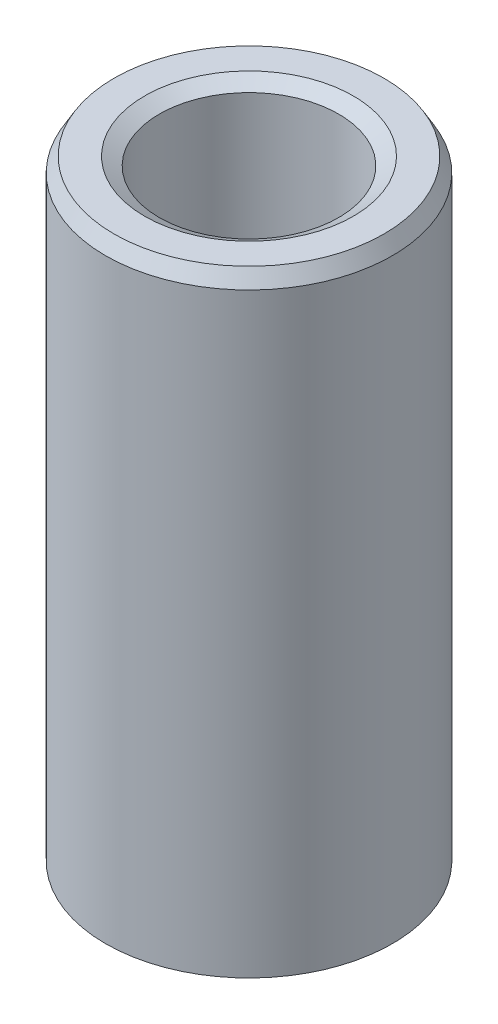
ISO-10303-21;
HEADER;
FILE_DESCRIPTION(('STEP AP214'),'2;1');
FILE_NAME('part.step','',(''),(''),'','','');
FILE_SCHEMA(('AUTOMOTIVE_DESIGN { 1 0 10303 214 1 1 1 1 }'));
ENDSEC;
DATA;
#1=APPLICATION_CONTEXT('core data for automotive mechanical design processes');
#2=APPLICATION_PROTOCOL_DEFINITION('international standard','automotive_design',2000,#1);
#3=PRODUCT_CONTEXT('',#1,'mechanical');
#4=PRODUCT('Part','Part','',(#3));
#5=PRODUCT_RELATED_PRODUCT_CATEGORY('part','',(#4));
#6=PRODUCT_DEFINITION_FORMATION('','',#4);
#7=PRODUCT_DEFINITION_CONTEXT('part definition',#1,'design');
#8=PRODUCT_DEFINITION('design','',#6,#7);
#9=PRODUCT_DEFINITION_SHAPE('','',#8);
#10=(LENGTH_UNIT() NAMED_UNIT(*) SI_UNIT(.MILLI.,.METRE.));
#11=(NAMED_UNIT(*) PLANE_ANGLE_UNIT() SI_UNIT($,.RADIAN.));
#12=(NAMED_UNIT(*) SI_UNIT($,.STERADIAN.) SOLID_ANGLE_UNIT());
#13=UNCERTAINTY_MEASURE_WITH_UNIT(LENGTH_MEASURE(1.E-05),#10,'distance_accuracy_value','');
#14=(GEOMETRIC_REPRESENTATION_CONTEXT(3) GLOBAL_UNCERTAINTY_ASSIGNED_CONTEXT((#13)) GLOBAL_UNIT_ASSIGNED_CONTEXT((#10,
#11,#12)) REPRESENTATION_CONTEXT('',''));
#15=CARTESIAN_POINT('',(0.,0.,0.));
#16=DIRECTION('',(0.,0.,1.));
#17=DIRECTION('',(1.,0.,0.));
#18=AXIS2_PLACEMENT_3D('',#15,#16,#17);
#19=CARTESIAN_POINT('',(0.,32.3666149001435,0.));
#20=DIRECTION('',(0.,-1.,0.));
#21=DIRECTION('',(0.,0.,-1.));
#22=AXIS2_PLACEMENT_3D('',#19,#20,#21);
#23=CYLINDRICAL_SURFACE('',#22,7.5);
#24=CARTESIAN_POINT('',(0.,0.441064014181924,0.));
#25=DIRECTION('',(0.,1.,0.));
#26=DIRECTION('',(0.,0.,1.));
#27=AXIS2_PLACEMENT_3D('',#24,#25,#26);
#28=CIRCLE('',#27,7.5);
#29=CARTESIAN_POINT('',(0.,0.441064014181924,7.5));
#30=VERTEX_POINT('',#29);
#31=EDGE_CURVE('E10',#30,#30,#28,.T.);
#32=ORIENTED_EDGE('',*,*,#31,.T.);
#33=EDGE_LOOP('',(#32));
#34=FACE_BOUND('',#33,.T.);
#35=CARTESIAN_POINT('',(0.,31.6026696181901,0.));
#36=DIRECTION('',(0.,1.,0.));
#37=DIRECTION('',(0.,0.,1.));
#38=AXIS2_PLACEMENT_3D('',#35,#36,#37);
#39=CIRCLE('',#38,7.5);
#40=CARTESIAN_POINT('',(0.,31.6026696181901,7.5));
#41=VERTEX_POINT('',#40);
#42=EDGE_CURVE('E50',#41,#41,#39,.F.);
#43=ORIENTED_EDGE('',*,*,#42,.T.);
#44=EDGE_LOOP('',(#43));
#45=FACE_BOUND('',#44,.T.);
#46=ADVANCED_FACE('F39',(#34,#45),#23,.T.);
#47=CARTESIAN_POINT('',(0.,32.3666149001435,0.));
#48=DIRECTION('',(0.,1.,0.));
#49=DIRECTION('',(0.,0.,1.));
#50=AXIS2_PLACEMENT_3D('',#47,#48,#49);
#51=PLANE('',#50);
#52=CARTESIAN_POINT('',(0.,32.3666149001435,0.));
#53=DIRECTION('',(0.,1.,0.));
#54=DIRECTION('',(0.,0.,1.));
#55=AXIS2_PLACEMENT_3D('',#52,#53,#54);
#56=CIRCLE('',#55,5.45577732087612);
#57=CARTESIAN_POINT('',(0.,32.3666149001435,5.45577732087612));
#58=VERTEX_POINT('',#57);
#59=EDGE_CURVE('E58',#58,#58,#56,.F.);
#60=ORIENTED_EDGE('',*,*,#59,.T.);
#61=EDGE_LOOP('',(#60));
#62=FACE_BOUND('',#61,.T.);
#63=CARTESIAN_POINT('',(0.,32.3666149001435,0.));
#64=DIRECTION('',(0.,1.,0.));
#65=DIRECTION('',(0.,0.,1.));
#66=AXIS2_PLACEMENT_3D('',#63,#64,#65);
#67=CIRCLE('',#66,7.05893598581808);
#68=CARTESIAN_POINT('',(0.,32.3666149001435,7.05893598581808));
#69=VERTEX_POINT('',#68);
#70=EDGE_CURVE('E61',#69,#69,#67,.T.);
#71=ORIENTED_EDGE('',*,*,#70,.T.);
#72=EDGE_LOOP('',(#71));
#73=FACE_BOUND('',#72,.T.);
#74=ADVANCED_FACE('F88',(#62,#73),#51,.T.);
#75=CARTESIAN_POINT('',(0.,0.,0.));
#76=DIRECTION('',(0.,1.,0.));
#77=DIRECTION('',(0.,0.,1.));
#78=AXIS2_PLACEMENT_3D('',#75,#76,#77);
#79=PLANE('',#78);
#80=CARTESIAN_POINT('',(0.,0.,0.));
#81=DIRECTION('',(0.,1.,0.));
#82=DIRECTION('',(0.,0.,1.));
#83=AXIS2_PLACEMENT_3D('',#80,#81,#82);
#84=CIRCLE('',#83,5.13289605310466);
#85=CARTESIAN_POINT('',(0.,0.,5.13289605310466));
#86=VERTEX_POINT('',#85);
#87=EDGE_CURVE('E51',#86,#86,#84,.T.);
#88=ORIENTED_EDGE('',*,*,#87,.T.);
#89=EDGE_LOOP('',(#88));
#90=FACE_BOUND('',#89,.T.);
#91=CARTESIAN_POINT('',(0.,0.,0.));
#92=DIRECTION('',(0.,1.,0.));
#93=DIRECTION('',(0.,0.,1.));
#94=AXIS2_PLACEMENT_3D('',#91,#92,#93);
#95=CIRCLE('',#94,6.73605471804662);
#96=CARTESIAN_POINT('',(0.,0.,6.73605471804662));
#97=VERTEX_POINT('',#96);
#98=EDGE_CURVE('E54',#97,#97,#95,.F.);
#99=ORIENTED_EDGE('',*,*,#98,.T.);
#100=EDGE_LOOP('',(#99));
#101=FACE_BOUND('',#100,.T.);
#102=ADVANCED_FACE('F83',(#90,#101),#79,.F.);
#103=CARTESIAN_POINT('',(0.,32.3666149001435,0.));
#104=DIRECTION('',(0.,-1.,0.));
#105=DIRECTION('',(0.,0.,-1.));
#106=AXIS2_PLACEMENT_3D('',#103,#104,#105);
#107=CYLINDRICAL_SURFACE('',#106,4.69183203892274);
#108=CARTESIAN_POINT('',(0.,31.9255508859616,0.));
#109=DIRECTION('',(0.,1.,0.));
#110=DIRECTION('',(0.,0.,1.));
#111=AXIS2_PLACEMENT_3D('',#108,#109,#110);
#112=CIRCLE('',#111,4.69183203892274);
#113=CARTESIAN_POINT('',(0.,31.9255508859616,4.69183203892274));
#114=VERTEX_POINT('',#113);
#115=EDGE_CURVE('E67',#114,#114,#112,.T.);
#116=ORIENTED_EDGE('',*,*,#115,.T.);
#117=EDGE_LOOP('',(#116));
#118=FACE_BOUND('',#117,.T.);
#119=CARTESIAN_POINT('',(0.,0.763945281953379,0.));
#120=DIRECTION('',(0.,1.,0.));
#121=DIRECTION('',(0.,0.,1.));
#122=AXIS2_PLACEMENT_3D('',#119,#120,#121);
#123=CIRCLE('',#122,4.69183203892274);
#124=CARTESIAN_POINT('',(0.,0.763945281953379,4.69183203892274));
#125=VERTEX_POINT('',#124);
#126=EDGE_CURVE('E69',#125,#125,#123,.F.);
#127=ORIENTED_EDGE('',*,*,#126,.T.);
#128=EDGE_LOOP('',(#127));
#129=FACE_BOUND('',#128,.T.);
#130=ADVANCED_FACE('F71',(#118,#129),#107,.F.);
#131=CARTESIAN_POINT('',(0.,31.9255508859616,0.));
#132=DIRECTION('',(0.,1.,0.));
#133=DIRECTION('',(0.,0.,1.));
#134=AXIS2_PLACEMENT_3D('',#131,#132,#133);
#135=CONICAL_SURFACE('',#134,4.69183203892274,1.0471975511966);
#136=ORIENTED_EDGE('',*,*,#59,.F.);
#137=EDGE_LOOP('',(#136));
#138=FACE_BOUND('',#137,.T.);
#139=ORIENTED_EDGE('',*,*,#115,.F.);
#140=EDGE_LOOP('',(#139));
#141=FACE_BOUND('',#140,.T.);
#142=ADVANCED_FACE('F77',(#138,#141),#135,.F.);
#143=CARTESIAN_POINT('',(0.,0.,0.));
#144=DIRECTION('',(0.,-1.,0.));
#145=DIRECTION('',(0.,0.,-1.));
#146=AXIS2_PLACEMENT_3D('',#143,#144,#145);
#147=CONICAL_SURFACE('',#146,5.13289605310466,0.523598775598294);
#148=ORIENTED_EDGE('',*,*,#126,.F.);
#149=EDGE_LOOP('',(#148));
#150=FACE_BOUND('',#149,.T.);
#151=ORIENTED_EDGE('',*,*,#87,.F.);
#152=EDGE_LOOP('',(#151));
#153=FACE_BOUND('',#152,.T.);
#154=ADVANCED_FACE('F73',(#150,#153),#147,.F.);
#155=CARTESIAN_POINT('',(0.,0.441064014181924,0.));
#156=DIRECTION('',(0.,1.,0.));
#157=DIRECTION('',(0.,0.,1.));
#158=AXIS2_PLACEMENT_3D('',#155,#156,#157);
#159=CONICAL_SURFACE('',#158,7.5,1.0471975511966);
#160=ORIENTED_EDGE('',*,*,#98,.F.);
#161=EDGE_LOOP('',(#160));
#162=FACE_BOUND('',#161,.T.);
#163=ORIENTED_EDGE('',*,*,#31,.F.);
#164=EDGE_LOOP('',(#163));
#165=FACE_BOUND('',#164,.T.);
#166=ADVANCED_FACE('F76',(#162,#165),#159,.T.);
#167=CARTESIAN_POINT('',(0.,32.3666149001435,0.));
#168=DIRECTION('',(0.,-1.,0.));
#169=DIRECTION('',(0.,0.,-1.));
#170=AXIS2_PLACEMENT_3D('',#167,#168,#169);
#171=CONICAL_SURFACE('',#170,7.05893598581808,0.523598775598292);
#172=ORIENTED_EDGE('',*,*,#42,.F.);
#173=EDGE_LOOP('',(#172));
#174=FACE_BOUND('',#173,.T.);
#175=ORIENTED_EDGE('',*,*,#70,.F.);
#176=EDGE_LOOP('',(#175));
#177=FACE_BOUND('',#176,.T.);
#178=ADVANCED_FACE('F45',(#174,#177),#171,.T.);
#179=CLOSED_SHELL('',(#46,#74,#102,#130,#142,#154,#166,#178));
#180=MANIFOLD_SOLID_BREP('B2',#179);
#181=ADVANCED_BREP_SHAPE_REPRESENTATION('',(#18,#180),#14);
#182=SHAPE_DEFINITION_REPRESENTATION(#9,#181);
ENDSEC;
END-ISO-10303-21;
